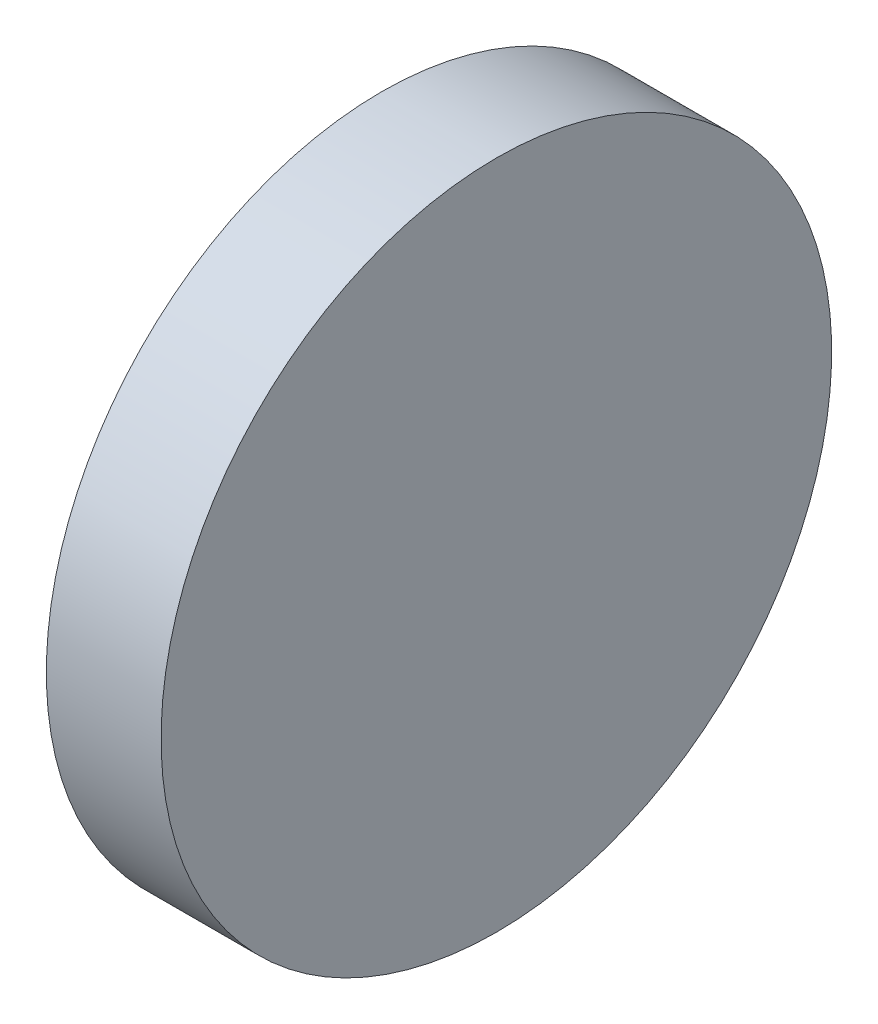
ISO-10303-21;
HEADER;
FILE_DESCRIPTION(('STEP AP214'),'2;1');
FILE_NAME('part.step','',(''),(''),'','','');
FILE_SCHEMA(('AUTOMOTIVE_DESIGN { 1 0 10303 214 1 1 1 1 }'));
ENDSEC;
DATA;
#1=APPLICATION_CONTEXT('core data for automotive mechanical design processes');
#2=APPLICATION_PROTOCOL_DEFINITION('international standard','automotive_design',2000,#1);
#3=PRODUCT_CONTEXT('',#1,'mechanical');
#4=PRODUCT('Part','Part','',(#3));
#5=PRODUCT_RELATED_PRODUCT_CATEGORY('part','',(#4));
#6=PRODUCT_DEFINITION_FORMATION('','',#4);
#7=PRODUCT_DEFINITION_CONTEXT('part definition',#1,'design');
#8=PRODUCT_DEFINITION('design','',#6,#7);
#9=PRODUCT_DEFINITION_SHAPE('','',#8);
#10=(LENGTH_UNIT() NAMED_UNIT(*) SI_UNIT(.MILLI.,.METRE.));
#11=(NAMED_UNIT(*) PLANE_ANGLE_UNIT() SI_UNIT($,.RADIAN.));
#12=(NAMED_UNIT(*) SI_UNIT($,.STERADIAN.) SOLID_ANGLE_UNIT());
#13=UNCERTAINTY_MEASURE_WITH_UNIT(LENGTH_MEASURE(1.E-05),#10,'distance_accuracy_value','');
#14=(GEOMETRIC_REPRESENTATION_CONTEXT(3) GLOBAL_UNCERTAINTY_ASSIGNED_CONTEXT((#13)) GLOBAL_UNIT_ASSIGNED_CONTEXT((#10,
#11,#12)) REPRESENTATION_CONTEXT('',''));
#15=CARTESIAN_POINT('',(0.,0.,0.));
#16=DIRECTION('',(0.,0.,1.));
#17=DIRECTION('',(1.,0.,0.));
#18=AXIS2_PLACEMENT_3D('',#15,#16,#17);
#19=CARTESIAN_POINT('',(-647.452257470346,41.8495901496081,214.659203324059));
#20=DIRECTION('',(1.,0.,0.));
#21=DIRECTION('',(0.,1.,0.));
#22=AXIS2_PLACEMENT_3D('',#19,#20,#21);
#23=CYLINDRICAL_SURFACE('',#22,74.2234752974486);
#24=CARTESIAN_POINT('',(-437.516566646114,41.8495901496088,214.659203324059));
#25=DIRECTION('',(1.,0.,0.));
#26=DIRECTION('',(0.,1.,0.));
#27=AXIS2_PLACEMENT_3D('',#24,#25,#26);
#28=CIRCLE('',#27,74.2234752974486);
#29=CARTESIAN_POINT('',(-437.516566646114,116.073065447057,214.659203324059));
#30=VERTEX_POINT('',#29);
#31=EDGE_CURVE('E10',#30,#30,#28,.F.);
#32=CARTESIAN_POINT('',(-412.116566646114,41.8495901496089,214.659203324059));
#33=DIRECTION('',(1.,0.,0.));
#34=DIRECTION('',(0.,1.,0.));
#35=AXIS2_PLACEMENT_3D('',#32,#33,#34);
#36=CIRCLE('',#35,74.2234752974486);
#37=CARTESIAN_POINT('',(-412.116566646114,116.073065447058,214.659203324059));
#38=VERTEX_POINT('',#37);
#39=EDGE_CURVE('E34',#38,#38,#36,.T.);
#40=CARTESIAN_POINT('',(-437.516566646114,116.073065447057,214.659203324059));
#41=CARTESIAN_POINT('',(-437.251983312781,116.073065447057,214.659203324059));
#42=CARTESIAN_POINT('',(-436.987399979448,116.073065447057,214.659203324059));
#43=CARTESIAN_POINT('',(-436.458233312781,116.073065447057,214.659203324059));
#44=CARTESIAN_POINT('',(-436.193649979448,116.073065447057,214.659203324059));
#45=CARTESIAN_POINT('',(-435.664483312781,116.073065447057,214.659203324059));
#46=CARTESIAN_POINT('',(-435.399899979448,116.073065447057,214.659203324059));
#47=CARTESIAN_POINT('',(-434.870733312781,116.073065447057,214.659203324059));
#48=CARTESIAN_POINT('',(-434.606149979448,116.073065447057,214.659203324059));
#49=CARTESIAN_POINT('',(-434.076983312781,116.073065447057,214.659203324059));
#50=CARTESIAN_POINT('',(-433.812399979448,116.073065447057,214.659203324059));
#51=CARTESIAN_POINT('',(-433.283233312781,116.073065447057,214.659203324059));
#52=CARTESIAN_POINT('',(-433.018649979448,116.073065447057,214.659203324059));
#53=CARTESIAN_POINT('',(-432.489483312781,116.073065447057,214.659203324059));
#54=CARTESIAN_POINT('',(-432.224899979448,116.073065447057,214.659203324059));
#55=CARTESIAN_POINT('',(-431.695733312781,116.073065447057,214.659203324059));
#56=CARTESIAN_POINT('',(-431.431149979448,116.073065447057,214.659203324059));
#57=CARTESIAN_POINT('',(-430.901983312781,116.073065447057,214.659203324059));
#58=CARTESIAN_POINT('',(-430.637399979447,116.073065447057,214.659203324059));
#59=CARTESIAN_POINT('',(-430.108233312781,116.073065447057,214.659203324059));
#60=CARTESIAN_POINT('',(-429.843649979447,116.073065447057,214.659203324059));
#61=CARTESIAN_POINT('',(-429.314483312781,116.073065447057,214.659203324059));
#62=CARTESIAN_POINT('',(-429.049899979448,116.073065447057,214.659203324059));
#63=CARTESIAN_POINT('',(-428.520733312781,116.073065447057,214.659203324059));
#64=CARTESIAN_POINT('',(-428.256149979448,116.073065447057,214.659203324059));
#65=CARTESIAN_POINT('',(-427.726983312781,116.073065447057,214.659203324059));
#66=CARTESIAN_POINT('',(-427.462399979448,116.073065447057,214.659203324059));
#67=CARTESIAN_POINT('',(-426.933233312781,116.073065447057,214.659203324059));
#68=CARTESIAN_POINT('',(-426.668649979448,116.073065447057,214.659203324059));
#69=CARTESIAN_POINT('',(-426.139483312781,116.073065447057,214.659203324059));
#70=CARTESIAN_POINT('',(-425.874899979447,116.073065447057,214.659203324059));
#71=CARTESIAN_POINT('',(-425.345733312781,116.073065447057,214.659203324059));
#72=CARTESIAN_POINT('',(-425.081149979448,116.073065447057,214.659203324059));
#73=CARTESIAN_POINT('',(-424.551983312781,116.073065447057,214.659203324059));
#74=CARTESIAN_POINT('',(-424.287399979448,116.073065447057,214.659203324059));
#75=CARTESIAN_POINT('',(-423.758233312781,116.073065447057,214.659203324059));
#76=CARTESIAN_POINT('',(-423.493649979447,116.073065447057,214.659203324059));
#77=CARTESIAN_POINT('',(-422.964483312781,116.073065447057,214.659203324059));
#78=CARTESIAN_POINT('',(-422.699899979448,116.073065447057,214.659203324059));
#79=CARTESIAN_POINT('',(-422.170733312781,116.073065447057,214.659203324059));
#80=CARTESIAN_POINT('',(-421.906149979448,116.073065447057,214.659203324059));
#81=CARTESIAN_POINT('',(-421.376983312781,116.073065447057,214.659203324059));
#82=CARTESIAN_POINT('',(-421.112399979448,116.073065447057,214.659203324059));
#83=CARTESIAN_POINT('',(-420.583233312781,116.073065447057,214.659203324059));
#84=CARTESIAN_POINT('',(-420.318649979448,116.073065447057,214.659203324059));
#85=CARTESIAN_POINT('',(-419.789483312781,116.073065447057,214.659203324059));
#86=CARTESIAN_POINT('',(-419.524899979448,116.073065447057,214.659203324059));
#87=CARTESIAN_POINT('',(-418.995733312781,116.073065447057,214.659203324059));
#88=CARTESIAN_POINT('',(-418.731149979447,116.073065447057,214.659203324059));
#89=CARTESIAN_POINT('',(-418.201983312781,116.073065447057,214.659203324059));
#90=CARTESIAN_POINT('',(-417.937399979447,116.073065447057,214.659203324059));
#91=CARTESIAN_POINT('',(-417.408233312781,116.073065447057,214.659203324059));
#92=CARTESIAN_POINT('',(-417.143649979448,116.073065447058,214.659203324059));
#93=CARTESIAN_POINT('',(-416.614483312781,116.073065447058,214.659203324059));
#94=CARTESIAN_POINT('',(-416.349899979448,116.073065447058,214.659203324059));
#95=CARTESIAN_POINT('',(-415.820733312781,116.073065447058,214.659203324059));
#96=CARTESIAN_POINT('',(-415.556149979448,116.073065447058,214.659203324059));
#97=CARTESIAN_POINT('',(-415.026983312781,116.073065447058,214.659203324059));
#98=CARTESIAN_POINT('',(-414.762399979448,116.073065447058,214.659203324059));
#99=CARTESIAN_POINT('',(-414.233233312781,116.073065447058,214.659203324059));
#100=CARTESIAN_POINT('',(-413.968649979447,116.073065447058,214.659203324059));
#101=CARTESIAN_POINT('',(-413.439483312781,116.073065447058,214.659203324059));
#102=CARTESIAN_POINT('',(-413.174899979448,116.073065447058,214.659203324059));
#103=CARTESIAN_POINT('',(-412.645733312781,116.073065447058,214.659203324059));
#104=CARTESIAN_POINT('',(-412.381149979448,116.073065447058,214.659203324059));
#105=CARTESIAN_POINT('',(-412.116566646114,116.073065447058,214.659203324059));
#106=B_SPLINE_CURVE_WITH_KNOTS('',3,(#40,#41,#42,#43,#44,#45,#46,#47,#48,#49,#50,#51,#52,#53,
#54,#55,#56,#57,#58,#59,#60,#61,#62,#63,#64,#65,#66,#67,#68,#69,#70,#71,#72,#73,#74,#75,#76,#77,
#78,#79,#80,#81,#82,#83,#84,#85,#86,#87,#88,#89,#90,#91,#92,#93,#94,#95,#96,#97,#98,#99,#100,
#101,#102,#103,#104,#105),.UNSPECIFIED.,.F.,.F.,(4,2,2,2,2,2,2,2,2,2,2,2,2,2,2,2,2,2,2,2,2,2,2,
2,2,2,2,2,2,2,2,2,4),(0.,0.793749999999982,1.58749999999996,2.38125,3.17499999999998,
3.96874999999997,4.7625,5.55624999999998,6.34999999999997,7.14375,7.93749999999999,
8.73124999999997,9.52500000000001,10.31875,11.1125,11.90625,12.7,13.49375,14.2875,15.08125,
15.875,16.66875,17.4625,18.25625,19.05,19.84375,20.6375,21.43125,22.225,23.01875,23.8125,
24.60625,25.4),.UNSPECIFIED.);
#107=EDGE_CURVE('BSEAM28',#30,#38,#106,.T.);
#108=ORIENTED_EDGE('',*,*,#31,.F.);
#109=ORIENTED_EDGE('',*,*,#39,.F.);
#110=ORIENTED_EDGE('',*,*,#107,.T.);
#111=ORIENTED_EDGE('',*,*,#107,.F.);
#112=EDGE_LOOP('',(#108,#110,#109,#111));
#113=FACE_BOUND('',#112,.T.);
#114=ADVANCED_FACE('F28',(#113),#23,.T.);
#115=CARTESIAN_POINT('',(-412.116566646114,-1.39978190915991E-12,-1.39978190915991E-13));
#116=DIRECTION('',(1.,0.,0.));
#117=DIRECTION('',(0.,1.,0.));
#118=AXIS2_PLACEMENT_3D('',#115,#116,#117);
#119=PLANE('',#118);
#120=ORIENTED_EDGE('',*,*,#39,.T.);
#121=EDGE_LOOP('',(#120));
#122=FACE_BOUND('',#121,.T.);
#123=ADVANCED_FACE('F40',(#122),#119,.T.);
#124=CARTESIAN_POINT('',(-437.516566646114,31.3373912364987,280.114440776926));
#125=DIRECTION('',(1.,0.,0.));
#126=DIRECTION('',(0.,0.158569386567566,-0.987347836197349));
#127=AXIS2_PLACEMENT_3D('',#124,#125,#126);
#128=PLANE('',#127);
#129=ORIENTED_EDGE('',*,*,#31,.T.);
#130=EDGE_LOOP('',(#129));
#131=FACE_BOUND('',#130,.T.);
#132=ADVANCED_FACE('F47',(#131),#128,.F.);
#133=CLOSED_SHELL('',(#114,#123,#132));
#134=MANIFOLD_SOLID_BREP('B2',#133);
#135=ADVANCED_BREP_SHAPE_REPRESENTATION('',(#18,#134),#14);
#136=SHAPE_DEFINITION_REPRESENTATION(#9,#135);
ENDSEC;
END-ISO-10303-21;
